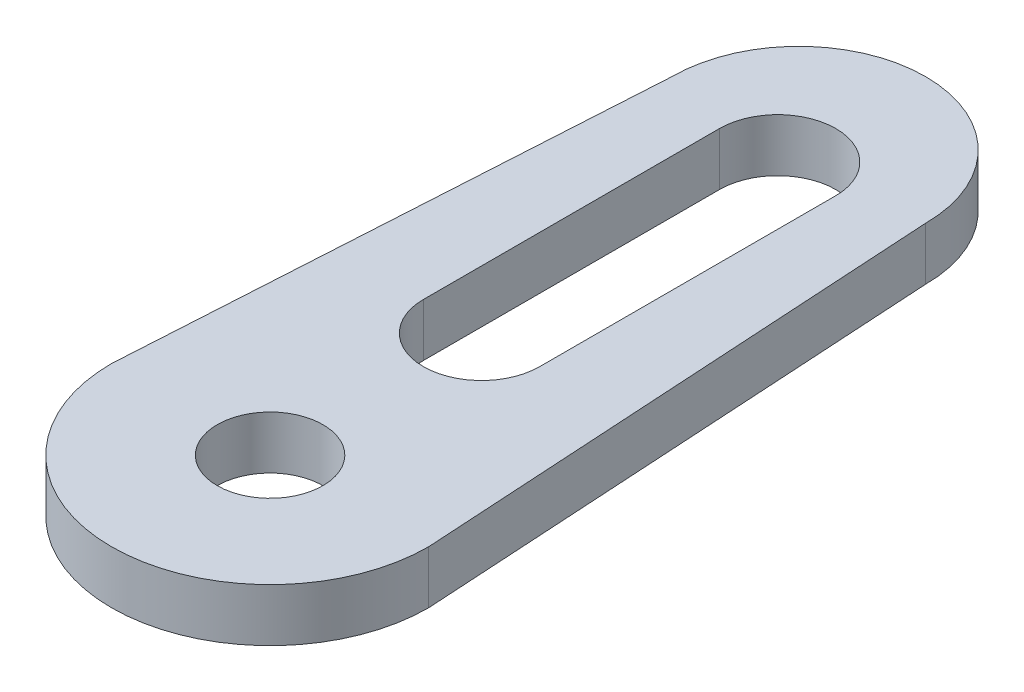
ISO-10303-21;
HEADER;
FILE_DESCRIPTION(('STEP AP214'),'2;1');
FILE_NAME('part.step','',(''),(''),'','','');
FILE_SCHEMA(('AUTOMOTIVE_DESIGN { 1 0 10303 214 1 1 1 1 }'));
ENDSEC;
DATA;
#1=APPLICATION_CONTEXT('core data for automotive mechanical design processes');
#2=APPLICATION_PROTOCOL_DEFINITION('international standard','automotive_design',2000,#1);
#3=PRODUCT_CONTEXT('',#1,'mechanical');
#4=PRODUCT('Part','Part','',(#3));
#5=PRODUCT_RELATED_PRODUCT_CATEGORY('part','',(#4));
#6=PRODUCT_DEFINITION_FORMATION('','',#4);
#7=PRODUCT_DEFINITION_CONTEXT('part definition',#1,'design');
#8=PRODUCT_DEFINITION('design','',#6,#7);
#9=PRODUCT_DEFINITION_SHAPE('','',#8);
#10=(LENGTH_UNIT() NAMED_UNIT(*) SI_UNIT(.MILLI.,.METRE.));
#11=(NAMED_UNIT(*) PLANE_ANGLE_UNIT() SI_UNIT($,.RADIAN.));
#12=(NAMED_UNIT(*) SI_UNIT($,.STERADIAN.) SOLID_ANGLE_UNIT());
#13=UNCERTAINTY_MEASURE_WITH_UNIT(LENGTH_MEASURE(1.E-05),#10,'distance_accuracy_value','');
#14=(GEOMETRIC_REPRESENTATION_CONTEXT(3) GLOBAL_UNCERTAINTY_ASSIGNED_CONTEXT((#13)) GLOBAL_UNIT_ASSIGNED_CONTEXT((#10,
#11,#12)) REPRESENTATION_CONTEXT('',''));
#15=CARTESIAN_POINT('',(0.,0.,0.));
#16=DIRECTION('',(0.,0.,1.));
#17=DIRECTION('',(1.,0.,0.));
#18=AXIS2_PLACEMENT_3D('',#15,#16,#17);
#19=CARTESIAN_POINT('',(0.,2.5,-25.));
#20=DIRECTION('',(0.,-1.,0.));
#21=DIRECTION('',(0.,0.,-1.));
#22=AXIS2_PLACEMENT_3D('',#19,#20,#21);
#23=CYLINDRICAL_SURFACE('',#22,6.);
#24=CARTESIAN_POINT('',(0.,0.,-25.));
#25=DIRECTION('',(0.,1.,0.));
#26=DIRECTION('',(0.,0.,1.));
#27=AXIS2_PLACEMENT_3D('',#24,#25,#26);
#28=CIRCLE('',#27,6.);
#29=CARTESIAN_POINT('',(6.,0.,-25.));
#30=VERTEX_POINT('',#29);
#31=CARTESIAN_POINT('',(-6.,0.,-25.));
#32=VERTEX_POINT('',#31);
#33=EDGE_CURVE('E152',#30,#32,#28,.T.);
#34=ORIENTED_EDGE('',*,*,#33,.T.);
#35=DIRECTION('',(0.,-1.,0.));
#36=VECTOR('',#35,1.);
#37=CARTESIAN_POINT('',(-6.,2.5,-25.));
#38=LINE('',#37,#36);
#39=CARTESIAN_POINT('',(-6.,2.5,-25.));
#40=VERTEX_POINT('',#39);
#41=EDGE_CURVE('E11',#40,#32,#38,.T.);
#42=ORIENTED_EDGE('',*,*,#41,.F.);
#43=CARTESIAN_POINT('',(0.,2.5,-25.));
#44=DIRECTION('',(0.,1.,0.));
#45=DIRECTION('',(0.,0.,1.));
#46=AXIS2_PLACEMENT_3D('',#43,#44,#45);
#47=CIRCLE('',#46,6.);
#48=CARTESIAN_POINT('',(6.,2.5,-25.));
#49=VERTEX_POINT('',#48);
#50=EDGE_CURVE('E165',#49,#40,#47,.T.);
#51=ORIENTED_EDGE('',*,*,#50,.F.);
#52=DIRECTION('',(0.,-1.,0.));
#53=VECTOR('',#52,1.);
#54=CARTESIAN_POINT('',(6.,2.5,-25.));
#55=LINE('',#54,#53);
#56=EDGE_CURVE('E179',#49,#30,#55,.T.);
#57=ORIENTED_EDGE('',*,*,#56,.T.);
#58=EDGE_LOOP('',(#34,#42,#51,#57));
#59=FACE_BOUND('',#58,.T.);
#60=ADVANCED_FACE('F43',(#59),#23,.T.);
#61=CARTESIAN_POINT('',(-6.,2.5,-25.));
#62=DIRECTION('',(0.998204845465779,0.,0.0598922907279467));
#63=DIRECTION('',(0.0598922907279467,0.,-0.998204845465779));
#64=AXIS2_PLACEMENT_3D('',#61,#62,#63);
#65=PLANE('',#64);
#66=DIRECTION('',(-0.0598922907279467,0.,0.998204845465779));
#67=VECTOR('',#66,1.);
#68=CARTESIAN_POINT('',(-6.,0.,-25.));
#69=LINE('',#68,#67);
#70=CARTESIAN_POINT('',(-7.5,0.,0.));
#71=VERTEX_POINT('',#70);
#72=EDGE_CURVE('E183',#32,#71,#69,.T.);
#73=ORIENTED_EDGE('',*,*,#72,.T.);
#74=DIRECTION('',(0.,-1.,0.));
#75=VECTOR('',#74,1.);
#76=CARTESIAN_POINT('',(-7.5,2.5,0.));
#77=LINE('',#76,#75);
#78=CARTESIAN_POINT('',(-7.5,2.5,0.));
#79=VERTEX_POINT('',#78);
#80=EDGE_CURVE('E51',#79,#71,#77,.T.);
#81=ORIENTED_EDGE('',*,*,#80,.F.);
#82=DIRECTION('',(-0.0598922907279467,0.,0.998204845465779));
#83=VECTOR('',#82,1.);
#84=CARTESIAN_POINT('',(-6.,2.5,-25.));
#85=LINE('',#84,#83);
#86=EDGE_CURVE('E169',#40,#79,#85,.T.);
#87=ORIENTED_EDGE('',*,*,#86,.F.);
#88=ORIENTED_EDGE('',*,*,#41,.T.);
#89=EDGE_LOOP('',(#73,#81,#87,#88));
#90=FACE_BOUND('',#89,.T.);
#91=ADVANCED_FACE('F218',(#90),#65,.F.);
#92=CARTESIAN_POINT('',(0.,2.5,0.));
#93=DIRECTION('',(0.,-1.,0.));
#94=DIRECTION('',(0.,0.,-1.));
#95=AXIS2_PLACEMENT_3D('',#92,#93,#94);
#96=CYLINDRICAL_SURFACE('',#95,7.5);
#97=CARTESIAN_POINT('',(0.,0.,0.));
#98=DIRECTION('',(0.,1.,0.));
#99=DIRECTION('',(0.,0.,1.));
#100=AXIS2_PLACEMENT_3D('',#97,#98,#99);
#101=CIRCLE('',#100,7.5);
#102=CARTESIAN_POINT('',(7.5,0.,0.));
#103=VERTEX_POINT('',#102);
#104=EDGE_CURVE('E186',#71,#103,#101,.T.);
#105=ORIENTED_EDGE('',*,*,#104,.T.);
#106=DIRECTION('',(0.,-1.,0.));
#107=VECTOR('',#106,1.);
#108=CARTESIAN_POINT('',(7.5,2.5,0.));
#109=LINE('',#108,#107);
#110=CARTESIAN_POINT('',(7.5,2.5,0.));
#111=VERTEX_POINT('',#110);
#112=EDGE_CURVE('E194',#111,#103,#109,.T.);
#113=ORIENTED_EDGE('',*,*,#112,.F.);
#114=CARTESIAN_POINT('',(0.,2.5,0.));
#115=DIRECTION('',(0.,1.,0.));
#116=DIRECTION('',(0.,0.,1.));
#117=AXIS2_PLACEMENT_3D('',#114,#115,#116);
#118=CIRCLE('',#117,7.5);
#119=EDGE_CURVE('E173',#79,#111,#118,.T.);
#120=ORIENTED_EDGE('',*,*,#119,.F.);
#121=ORIENTED_EDGE('',*,*,#80,.T.);
#122=EDGE_LOOP('',(#105,#113,#120,#121));
#123=FACE_BOUND('',#122,.T.);
#124=ADVANCED_FACE('F203',(#123),#96,.T.);
#125=CARTESIAN_POINT('',(6.,2.5,-25.));
#126=DIRECTION('',(-0.998204845465779,0.,0.0598922907279467));
#127=DIRECTION('',(0.0598922907279467,0.,0.998204845465779));
#128=AXIS2_PLACEMENT_3D('',#125,#126,#127);
#129=PLANE('',#128);
#130=DIRECTION('',(-0.0598922907279467,0.,-0.998204845465779));
#131=VECTOR('',#130,1.);
#132=CARTESIAN_POINT('',(6.,0.,-25.));
#133=LINE('',#132,#131);
#134=EDGE_CURVE('E170',#103,#30,#133,.T.);
#135=ORIENTED_EDGE('',*,*,#134,.T.);
#136=ORIENTED_EDGE('',*,*,#56,.F.);
#137=DIRECTION('',(-0.0598922907279467,0.,-0.998204845465779));
#138=VECTOR('',#137,1.);
#139=CARTESIAN_POINT('',(6.,2.5,-25.));
#140=LINE('',#139,#138);
#141=EDGE_CURVE('E176',#111,#49,#140,.T.);
#142=ORIENTED_EDGE('',*,*,#141,.F.);
#143=ORIENTED_EDGE('',*,*,#112,.T.);
#144=EDGE_LOOP('',(#135,#136,#142,#143));
#145=FACE_BOUND('',#144,.T.);
#146=ADVANCED_FACE('F211',(#145),#129,.F.);
#147=CARTESIAN_POINT('',(0.,2.5,-25.));
#148=DIRECTION('',(0.,1.,0.));
#149=DIRECTION('',(0.,0.,1.));
#150=AXIS2_PLACEMENT_3D('',#147,#148,#149);
#151=PLANE('',#150);
#152=CARTESIAN_POINT('',(0.,2.5,-24.));
#153=DIRECTION('',(0.,1.,0.));
#154=DIRECTION('',(0.,0.,1.));
#155=AXIS2_PLACEMENT_3D('',#152,#153,#154);
#156=CIRCLE('',#155,2.75);
#157=CARTESIAN_POINT('',(2.75,2.5,-24.));
#158=VERTEX_POINT('',#157);
#159=CARTESIAN_POINT('',(-2.75,2.5,-24.));
#160=VERTEX_POINT('',#159);
#161=EDGE_CURVE('E58',#158,#160,#156,.T.);
#162=ORIENTED_EDGE('',*,*,#161,.F.);
#163=DIRECTION('',(0.,0.,-1.));
#164=VECTOR('',#163,1.);
#165=CARTESIAN_POINT('',(2.75,2.5,-24.));
#166=LINE('',#165,#164);
#167=CARTESIAN_POINT('',(2.75,2.5,-10.));
#168=VERTEX_POINT('',#167);
#169=EDGE_CURVE('E129',#168,#158,#166,.T.);
#170=ORIENTED_EDGE('',*,*,#169,.F.);
#171=CARTESIAN_POINT('',(0.,2.5,-10.));
#172=DIRECTION('',(0.,1.,0.));
#173=DIRECTION('',(0.,0.,1.));
#174=AXIS2_PLACEMENT_3D('',#171,#172,#173);
#175=CIRCLE('',#174,2.75);
#176=CARTESIAN_POINT('',(-2.75,2.5,-10.));
#177=VERTEX_POINT('',#176);
#178=EDGE_CURVE('E133',#177,#168,#175,.T.);
#179=ORIENTED_EDGE('',*,*,#178,.F.);
#180=DIRECTION('',(0.,0.,1.));
#181=VECTOR('',#180,1.);
#182=CARTESIAN_POINT('',(-2.75,2.5,-24.));
#183=LINE('',#182,#181);
#184=EDGE_CURVE('E142',#160,#177,#183,.T.);
#185=ORIENTED_EDGE('',*,*,#184,.F.);
#186=EDGE_LOOP('',(#162,#170,#179,#185));
#187=FACE_BOUND('',#186,.T.);
#188=CARTESIAN_POINT('',(0.,2.5,0.));
#189=DIRECTION('',(0.,1.,0.));
#190=DIRECTION('',(0.,0.,1.));
#191=AXIS2_PLACEMENT_3D('',#188,#189,#190);
#192=CIRCLE('',#191,2.5);
#193=CARTESIAN_POINT('',(0.,2.5,2.5));
#194=VERTEX_POINT('',#193);
#195=EDGE_CURVE('E143',#194,#194,#192,.T.);
#196=ORIENTED_EDGE('',*,*,#195,.F.);
#197=EDGE_LOOP('',(#196));
#198=FACE_BOUND('',#197,.T.);
#199=ORIENTED_EDGE('',*,*,#50,.T.);
#200=ORIENTED_EDGE('',*,*,#86,.T.);
#201=ORIENTED_EDGE('',*,*,#119,.T.);
#202=ORIENTED_EDGE('',*,*,#141,.T.);
#203=EDGE_LOOP('',(#199,#200,#201,#202));
#204=FACE_BOUND('',#203,.T.);
#205=ADVANCED_FACE('F217',(#187,#198,#204),#151,.T.);
#206=CARTESIAN_POINT('',(0.,0.,-25.));
#207=DIRECTION('',(0.,1.,0.));
#208=DIRECTION('',(0.,0.,1.));
#209=AXIS2_PLACEMENT_3D('',#206,#207,#208);
#210=PLANE('',#209);
#211=DIRECTION('',(0.,0.,-1.));
#212=VECTOR('',#211,1.);
#213=CARTESIAN_POINT('',(2.75,0.,-24.));
#214=LINE('',#213,#212);
#215=CARTESIAN_POINT('',(2.75,0.,-10.));
#216=VERTEX_POINT('',#215);
#217=CARTESIAN_POINT('',(2.75,0.,-24.));
#218=VERTEX_POINT('',#217);
#219=EDGE_CURVE('E117',#216,#218,#214,.T.);
#220=ORIENTED_EDGE('',*,*,#219,.T.);
#221=CARTESIAN_POINT('',(0.,0.,-24.));
#222=DIRECTION('',(0.,1.,0.));
#223=DIRECTION('',(0.,0.,1.));
#224=AXIS2_PLACEMENT_3D('',#221,#222,#223);
#225=CIRCLE('',#224,2.75);
#226=CARTESIAN_POINT('',(-2.75,0.,-24.));
#227=VERTEX_POINT('',#226);
#228=EDGE_CURVE('E110',#218,#227,#225,.T.);
#229=ORIENTED_EDGE('',*,*,#228,.T.);
#230=DIRECTION('',(0.,0.,1.));
#231=VECTOR('',#230,1.);
#232=CARTESIAN_POINT('',(-2.75,0.,-24.));
#233=LINE('',#232,#231);
#234=CARTESIAN_POINT('',(-2.75,0.,-10.));
#235=VERTEX_POINT('',#234);
#236=EDGE_CURVE('E120',#227,#235,#233,.T.);
#237=ORIENTED_EDGE('',*,*,#236,.T.);
#238=CARTESIAN_POINT('',(0.,0.,-10.));
#239=DIRECTION('',(0.,1.,0.));
#240=DIRECTION('',(0.,0.,1.));
#241=AXIS2_PLACEMENT_3D('',#238,#239,#240);
#242=CIRCLE('',#241,2.75);
#243=EDGE_CURVE('E66',#235,#216,#242,.T.);
#244=ORIENTED_EDGE('',*,*,#243,.T.);
#245=EDGE_LOOP('',(#220,#229,#237,#244));
#246=FACE_BOUND('',#245,.T.);
#247=CARTESIAN_POINT('',(0.,0.,0.));
#248=DIRECTION('',(0.,1.,0.));
#249=DIRECTION('',(0.,0.,1.));
#250=AXIS2_PLACEMENT_3D('',#247,#248,#249);
#251=CIRCLE('',#250,2.5);
#252=CARTESIAN_POINT('',(0.,0.,2.5));
#253=VERTEX_POINT('',#252);
#254=EDGE_CURVE('E161',#253,#253,#251,.T.);
#255=ORIENTED_EDGE('',*,*,#254,.T.);
#256=EDGE_LOOP('',(#255));
#257=FACE_BOUND('',#256,.T.);
#258=ORIENTED_EDGE('',*,*,#33,.F.);
#259=ORIENTED_EDGE('',*,*,#134,.F.);
#260=ORIENTED_EDGE('',*,*,#104,.F.);
#261=ORIENTED_EDGE('',*,*,#72,.F.);
#262=EDGE_LOOP('',(#258,#259,#260,#261));
#263=FACE_BOUND('',#262,.T.);
#264=ADVANCED_FACE('F125',(#246,#257,#263),#210,.F.);
#265=CARTESIAN_POINT('',(0.,0.,0.));
#266=DIRECTION('',(0.,1.,0.));
#267=DIRECTION('',(0.,0.,1.));
#268=AXIS2_PLACEMENT_3D('',#265,#266,#267);
#269=CYLINDRICAL_SURFACE('',#268,2.5);
#270=ORIENTED_EDGE('',*,*,#254,.F.);
#271=EDGE_LOOP('',(#270));
#272=FACE_BOUND('',#271,.T.);
#273=ORIENTED_EDGE('',*,*,#195,.T.);
#274=EDGE_LOOP('',(#273));
#275=FACE_BOUND('',#274,.T.);
#276=ADVANCED_FACE('F230',(#272,#275),#269,.F.);
#277=CARTESIAN_POINT('',(0.,0.,-24.));
#278=DIRECTION('',(0.,1.,0.));
#279=DIRECTION('',(0.,0.,1.));
#280=AXIS2_PLACEMENT_3D('',#277,#278,#279);
#281=CYLINDRICAL_SURFACE('',#280,2.75);
#282=ORIENTED_EDGE('',*,*,#161,.T.);
#283=DIRECTION('',(0.,1.,0.));
#284=VECTOR('',#283,1.);
#285=CARTESIAN_POINT('',(-2.75,0.,-24.));
#286=LINE('',#285,#284);
#287=EDGE_CURVE('E106',#227,#160,#286,.T.);
#288=ORIENTED_EDGE('',*,*,#287,.F.);
#289=ORIENTED_EDGE('',*,*,#228,.F.);
#290=DIRECTION('',(0.,1.,0.));
#291=VECTOR('',#290,1.);
#292=CARTESIAN_POINT('',(2.75,0.,-24.));
#293=LINE('',#292,#291);
#294=EDGE_CURVE('E149',#218,#158,#293,.T.);
#295=ORIENTED_EDGE('',*,*,#294,.T.);
#296=EDGE_LOOP('',(#282,#288,#289,#295));
#297=FACE_BOUND('',#296,.T.);
#298=ADVANCED_FACE('F108',(#297),#281,.F.);
#299=CARTESIAN_POINT('',(2.75,0.,-24.));
#300=DIRECTION('',(1.,0.,0.));
#301=DIRECTION('',(0.,0.,-1.));
#302=AXIS2_PLACEMENT_3D('',#299,#300,#301);
#303=PLANE('',#302);
#304=ORIENTED_EDGE('',*,*,#169,.T.);
#305=ORIENTED_EDGE('',*,*,#294,.F.);
#306=ORIENTED_EDGE('',*,*,#219,.F.);
#307=DIRECTION('',(0.,1.,0.));
#308=VECTOR('',#307,1.);
#309=CARTESIAN_POINT('',(2.75,0.,-10.));
#310=LINE('',#309,#308);
#311=EDGE_CURVE('E153',#216,#168,#310,.T.);
#312=ORIENTED_EDGE('',*,*,#311,.T.);
#313=EDGE_LOOP('',(#304,#305,#306,#312));
#314=FACE_BOUND('',#313,.T.);
#315=ADVANCED_FACE('F239',(#314),#303,.F.);
#316=CARTESIAN_POINT('',(0.,0.,-10.));
#317=DIRECTION('',(0.,1.,0.));
#318=DIRECTION('',(0.,0.,1.));
#319=AXIS2_PLACEMENT_3D('',#316,#317,#318);
#320=CYLINDRICAL_SURFACE('',#319,2.75);
#321=ORIENTED_EDGE('',*,*,#178,.T.);
#322=ORIENTED_EDGE('',*,*,#311,.F.);
#323=ORIENTED_EDGE('',*,*,#243,.F.);
#324=DIRECTION('',(0.,1.,0.));
#325=VECTOR('',#324,1.);
#326=CARTESIAN_POINT('',(-2.75,0.,-10.));
#327=LINE('',#326,#325);
#328=EDGE_CURVE('E116',#235,#177,#327,.T.);
#329=ORIENTED_EDGE('',*,*,#328,.T.);
#330=EDGE_LOOP('',(#321,#322,#323,#329));
#331=FACE_BOUND('',#330,.T.);
#332=ADVANCED_FACE('F242',(#331),#320,.F.);
#333=CARTESIAN_POINT('',(-2.75,0.,-24.));
#334=DIRECTION('',(-1.,0.,0.));
#335=DIRECTION('',(0.,0.,1.));
#336=AXIS2_PLACEMENT_3D('',#333,#334,#335);
#337=PLANE('',#336);
#338=ORIENTED_EDGE('',*,*,#184,.T.);
#339=ORIENTED_EDGE('',*,*,#328,.F.);
#340=ORIENTED_EDGE('',*,*,#236,.F.);
#341=ORIENTED_EDGE('',*,*,#287,.T.);
#342=EDGE_LOOP('',(#338,#339,#340,#341));
#343=FACE_BOUND('',#342,.T.);
#344=ADVANCED_FACE('F121',(#343),#337,.F.);
#345=CLOSED_SHELL('',(#60,#91,#124,#146,#205,#264,#276,#298,#315,#332,#344));
#346=MANIFOLD_SOLID_BREP('B2',#345);
#347=ADVANCED_BREP_SHAPE_REPRESENTATION('',(#18,#346),#14);
#348=SHAPE_DEFINITION_REPRESENTATION(#9,#347);
ENDSEC;
END-ISO-10303-21;
